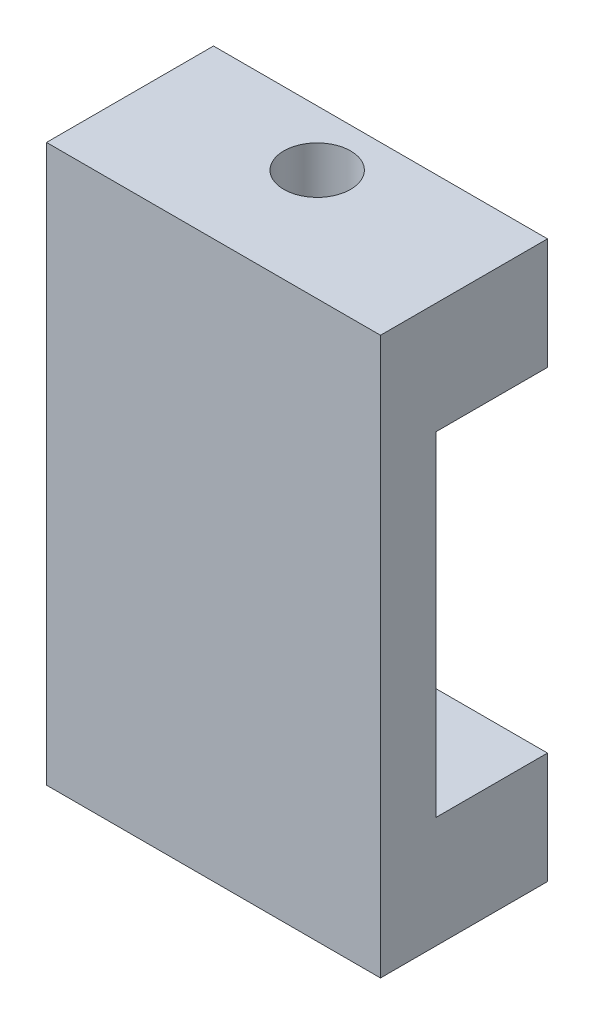
ISO-10303-21;
HEADER;
FILE_DESCRIPTION(('STEP AP214'),'2;1');
FILE_NAME('part.step','',(''),(''),'','','');
FILE_SCHEMA(('AUTOMOTIVE_DESIGN { 1 0 10303 214 1 1 1 1 }'));
ENDSEC;
DATA;
#1=APPLICATION_CONTEXT('core data for automotive mechanical design processes');
#2=APPLICATION_PROTOCOL_DEFINITION('international standard','automotive_design',2000,#1);
#3=PRODUCT_CONTEXT('',#1,'mechanical');
#4=PRODUCT('Part','Part','',(#3));
#5=PRODUCT_RELATED_PRODUCT_CATEGORY('part','',(#4));
#6=PRODUCT_DEFINITION_FORMATION('','',#4);
#7=PRODUCT_DEFINITION_CONTEXT('part definition',#1,'design');
#8=PRODUCT_DEFINITION('design','',#6,#7);
#9=PRODUCT_DEFINITION_SHAPE('','',#8);
#10=(LENGTH_UNIT() NAMED_UNIT(*) SI_UNIT(.MILLI.,.METRE.));
#11=(NAMED_UNIT(*) PLANE_ANGLE_UNIT() SI_UNIT($,.RADIAN.));
#12=(NAMED_UNIT(*) SI_UNIT($,.STERADIAN.) SOLID_ANGLE_UNIT());
#13=UNCERTAINTY_MEASURE_WITH_UNIT(LENGTH_MEASURE(1.E-05),#10,'distance_accuracy_value','');
#14=(GEOMETRIC_REPRESENTATION_CONTEXT(3) GLOBAL_UNCERTAINTY_ASSIGNED_CONTEXT((#13)) GLOBAL_UNIT_ASSIGNED_CONTEXT((#10,
#11,#12)) REPRESENTATION_CONTEXT('',''));
#15=CARTESIAN_POINT('',(0.,0.,0.));
#16=DIRECTION('',(0.,0.,1.));
#17=DIRECTION('',(1.,0.,0.));
#18=AXIS2_PLACEMENT_3D('',#15,#16,#17);
#19=CARTESIAN_POINT('',(-15.,0.,-2.5));
#20=DIRECTION('',(1.,0.,0.));
#21=DIRECTION('',(0.,1.,0.));
#22=AXIS2_PLACEMENT_3D('',#19,#20,#21);
#23=PLANE('',#22);
#24=DIRECTION('',(0.,1.,0.));
#25=VECTOR('',#24,1.);
#26=CARTESIAN_POINT('',(-15.,0.,-2.5));
#27=LINE('',#26,#25);
#28=CARTESIAN_POINT('',(-15.,-15.,-2.5));
#29=VERTEX_POINT('',#28);
#30=CARTESIAN_POINT('',(-15.,15.,-2.5));
#31=VERTEX_POINT('',#30);
#32=EDGE_CURVE('E166',#29,#31,#27,.T.);
#33=ORIENTED_EDGE('',*,*,#32,.F.);
#34=DIRECTION('',(0.,0.,1.));
#35=VECTOR('',#34,1.);
#36=CARTESIAN_POINT('',(-15.,-15.,2.5));
#37=LINE('',#36,#35);
#38=CARTESIAN_POINT('',(-15.,-15.,-12.5));
#39=VERTEX_POINT('',#38);
#40=EDGE_CURVE('E56',#39,#29,#37,.T.);
#41=ORIENTED_EDGE('',*,*,#40,.F.);
#42=DIRECTION('',(0.,1.,0.));
#43=VECTOR('',#42,1.);
#44=CARTESIAN_POINT('',(-15.,-25.,-12.5));
#45=LINE('',#44,#43);
#46=CARTESIAN_POINT('',(-15.,-25.,-12.5));
#47=VERTEX_POINT('',#46);
#48=EDGE_CURVE('E99',#47,#39,#45,.T.);
#49=ORIENTED_EDGE('',*,*,#48,.F.);
#50=DIRECTION('',(0.,0.,1.));
#51=VECTOR('',#50,1.);
#52=CARTESIAN_POINT('',(-15.,-25.,2.5));
#53=LINE('',#52,#51);
#54=CARTESIAN_POINT('',(-15.,-25.,2.5));
#55=VERTEX_POINT('',#54);
#56=EDGE_CURVE('E102',#47,#55,#53,.T.);
#57=ORIENTED_EDGE('',*,*,#56,.T.);
#58=DIRECTION('',(0.,1.,0.));
#59=VECTOR('',#58,1.);
#60=CARTESIAN_POINT('',(-15.,0.,2.5));
#61=LINE('',#60,#59);
#62=CARTESIAN_POINT('',(-15.,25.,2.5));
#63=VERTEX_POINT('',#62);
#64=EDGE_CURVE('E162',#55,#63,#61,.T.);
#65=ORIENTED_EDGE('',*,*,#64,.T.);
#66=DIRECTION('',(0.,0.,1.));
#67=VECTOR('',#66,1.);
#68=CARTESIAN_POINT('',(-15.,25.,2.5));
#69=LINE('',#68,#67);
#70=CARTESIAN_POINT('',(-15.,25.,-12.5));
#71=VERTEX_POINT('',#70);
#72=EDGE_CURVE('E140',#71,#63,#69,.T.);
#73=ORIENTED_EDGE('',*,*,#72,.F.);
#74=DIRECTION('',(0.,-1.,0.));
#75=VECTOR('',#74,1.);
#76=CARTESIAN_POINT('',(-15.,25.,-12.5));
#77=LINE('',#76,#75);
#78=CARTESIAN_POINT('',(-15.,15.,-12.5));
#79=VERTEX_POINT('',#78);
#80=EDGE_CURVE('E151',#71,#79,#77,.T.);
#81=ORIENTED_EDGE('',*,*,#80,.T.);
#82=DIRECTION('',(0.,0.,1.));
#83=VECTOR('',#82,1.);
#84=CARTESIAN_POINT('',(-15.,15.,2.5));
#85=LINE('',#84,#83);
#86=EDGE_CURVE('E137',#79,#31,#85,.T.);
#87=ORIENTED_EDGE('',*,*,#86,.T.);
#88=EDGE_LOOP('',(#33,#41,#49,#57,#65,#73,#81,#87));
#89=FACE_BOUND('',#88,.T.);
#90=ADVANCED_FACE('F35',(#89),#23,.F.);
#91=CARTESIAN_POINT('',(15.,0.,-2.5));
#92=DIRECTION('',(1.,0.,0.));
#93=DIRECTION('',(0.,0.,-1.));
#94=AXIS2_PLACEMENT_3D('',#91,#92,#93);
#95=PLANE('',#94);
#96=DIRECTION('',(0.,1.,0.));
#97=VECTOR('',#96,1.);
#98=CARTESIAN_POINT('',(15.,0.,-2.5));
#99=LINE('',#98,#97);
#100=CARTESIAN_POINT('',(15.,-15.,-2.5));
#101=VERTEX_POINT('',#100);
#102=CARTESIAN_POINT('',(15.,15.,-2.5));
#103=VERTEX_POINT('',#102);
#104=EDGE_CURVE('E42',#101,#103,#99,.T.);
#105=ORIENTED_EDGE('',*,*,#104,.T.);
#106=DIRECTION('',(0.,0.,-1.));
#107=VECTOR('',#106,1.);
#108=CARTESIAN_POINT('',(15.,15.,2.5));
#109=LINE('',#108,#107);
#110=CARTESIAN_POINT('',(15.,15.,-12.5));
#111=VERTEX_POINT('',#110);
#112=EDGE_CURVE('E154',#103,#111,#109,.T.);
#113=ORIENTED_EDGE('',*,*,#112,.T.);
#114=DIRECTION('',(0.,-1.,0.));
#115=VECTOR('',#114,1.);
#116=CARTESIAN_POINT('',(15.,25.,-12.5));
#117=LINE('',#116,#115);
#118=CARTESIAN_POINT('',(15.,25.,-12.5));
#119=VERTEX_POINT('',#118);
#120=EDGE_CURVE('E159',#119,#111,#117,.T.);
#121=ORIENTED_EDGE('',*,*,#120,.F.);
#122=DIRECTION('',(0.,0.,-1.));
#123=VECTOR('',#122,1.);
#124=CARTESIAN_POINT('',(15.,25.,2.5));
#125=LINE('',#124,#123);
#126=CARTESIAN_POINT('',(15.,25.,2.5));
#127=VERTEX_POINT('',#126);
#128=EDGE_CURVE('E147',#127,#119,#125,.T.);
#129=ORIENTED_EDGE('',*,*,#128,.F.);
#130=DIRECTION('',(0.,1.,0.));
#131=VECTOR('',#130,1.);
#132=CARTESIAN_POINT('',(15.,0.,2.5));
#133=LINE('',#132,#131);
#134=CARTESIAN_POINT('',(15.,-25.,2.5));
#135=VERTEX_POINT('',#134);
#136=EDGE_CURVE('E164',#135,#127,#133,.T.);
#137=ORIENTED_EDGE('',*,*,#136,.F.);
#138=DIRECTION('',(0.,0.,-1.));
#139=VECTOR('',#138,1.);
#140=CARTESIAN_POINT('',(15.,-25.,2.5));
#141=LINE('',#140,#139);
#142=CARTESIAN_POINT('',(15.,-25.,-12.5));
#143=VERTEX_POINT('',#142);
#144=EDGE_CURVE('E122',#135,#143,#141,.T.);
#145=ORIENTED_EDGE('',*,*,#144,.T.);
#146=DIRECTION('',(0.,1.,0.));
#147=VECTOR('',#146,1.);
#148=CARTESIAN_POINT('',(15.,-25.,-12.5));
#149=LINE('',#148,#147);
#150=CARTESIAN_POINT('',(15.,-15.,-12.5));
#151=VERTEX_POINT('',#150);
#152=EDGE_CURVE('E108',#143,#151,#149,.T.);
#153=ORIENTED_EDGE('',*,*,#152,.T.);
#154=DIRECTION('',(0.,0.,-1.));
#155=VECTOR('',#154,1.);
#156=CARTESIAN_POINT('',(15.,-15.,2.5));
#157=LINE('',#156,#155);
#158=EDGE_CURVE('E118',#101,#151,#157,.T.);
#159=ORIENTED_EDGE('',*,*,#158,.F.);
#160=EDGE_LOOP('',(#105,#113,#121,#129,#137,#145,#153,#159));
#161=FACE_BOUND('',#160,.T.);
#162=ADVANCED_FACE('F180',(#161),#95,.T.);
#163=CARTESIAN_POINT('',(0.,0.,-2.5));
#164=DIRECTION('',(0.,0.,1.));
#165=DIRECTION('',(1.,0.,0.));
#166=AXIS2_PLACEMENT_3D('',#163,#164,#165);
#167=PLANE('',#166);
#168=ORIENTED_EDGE('',*,*,#32,.T.);
#169=DIRECTION('',(-1.,0.,0.));
#170=VECTOR('',#169,1.);
#171=CARTESIAN_POINT('',(0.,15.,-2.5));
#172=LINE('',#171,#170);
#173=EDGE_CURVE('E11',#103,#31,#172,.T.);
#174=ORIENTED_EDGE('',*,*,#173,.F.);
#175=ORIENTED_EDGE('',*,*,#104,.F.);
#176=DIRECTION('',(-1.,0.,0.));
#177=VECTOR('',#176,1.);
#178=CARTESIAN_POINT('',(0.,-15.,-2.5));
#179=LINE('',#178,#177);
#180=EDGE_CURVE('E168',#101,#29,#179,.T.);
#181=ORIENTED_EDGE('',*,*,#180,.T.);
#182=EDGE_LOOP('',(#168,#174,#175,#181));
#183=FACE_BOUND('',#182,.T.);
#184=ADVANCED_FACE('F170',(#183),#167,.F.);
#185=CARTESIAN_POINT('',(0.,0.,2.5));
#186=DIRECTION('',(0.,0.,1.));
#187=DIRECTION('',(1.,0.,0.));
#188=AXIS2_PLACEMENT_3D('',#185,#186,#187);
#189=PLANE('',#188);
#190=ORIENTED_EDGE('',*,*,#64,.F.);
#191=DIRECTION('',(1.,0.,0.));
#192=VECTOR('',#191,1.);
#193=CARTESIAN_POINT('',(-15.,-25.,2.5));
#194=LINE('',#193,#192);
#195=EDGE_CURVE('E117',#55,#135,#194,.T.);
#196=ORIENTED_EDGE('',*,*,#195,.T.);
#197=ORIENTED_EDGE('',*,*,#136,.T.);
#198=DIRECTION('',(1.,0.,0.));
#199=VECTOR('',#198,1.);
#200=CARTESIAN_POINT('',(-15.,25.,2.5));
#201=LINE('',#200,#199);
#202=EDGE_CURVE('E143',#63,#127,#201,.T.);
#203=ORIENTED_EDGE('',*,*,#202,.F.);
#204=EDGE_LOOP('',(#190,#196,#197,#203));
#205=FACE_BOUND('',#204,.T.);
#206=ADVANCED_FACE('F190',(#205),#189,.T.);
#207=CARTESIAN_POINT('',(0.,25.,0.));
#208=DIRECTION('',(0.,-1.,0.));
#209=DIRECTION('',(1.,0.,0.));
#210=AXIS2_PLACEMENT_3D('',#207,#208,#209);
#211=PLANE('',#210);
#212=ORIENTED_EDGE('',*,*,#72,.T.);
#213=ORIENTED_EDGE('',*,*,#202,.T.);
#214=ORIENTED_EDGE('',*,*,#128,.T.);
#215=DIRECTION('',(-1.,0.,0.));
#216=VECTOR('',#215,1.);
#217=CARTESIAN_POINT('',(-15.,25.,-12.5));
#218=LINE('',#217,#216);
#219=EDGE_CURVE('E149',#119,#71,#218,.T.);
#220=ORIENTED_EDGE('',*,*,#219,.T.);
#221=EDGE_LOOP('',(#212,#213,#214,#220));
#222=FACE_BOUND('',#221,.T.);
#223=CARTESIAN_POINT('',(-0.685637394425955,25.,-7.5));
#224=DIRECTION('',(0.,1.,0.));
#225=DIRECTION('',(-1.,0.,0.));
#226=AXIS2_PLACEMENT_3D('',#223,#224,#225);
#227=CIRCLE('',#226,3.);
#228=CARTESIAN_POINT('',(-3.68563739442595,25.,-7.5));
#229=VERTEX_POINT('',#228);
#230=EDGE_CURVE('E134',#229,#229,#227,.T.);
#231=ORIENTED_EDGE('',*,*,#230,.F.);
#232=EDGE_LOOP('',(#231));
#233=FACE_BOUND('',#232,.T.);
#234=ADVANCED_FACE('F186',(#222,#233),#211,.F.);
#235=CARTESIAN_POINT('',(0.,15.,0.));
#236=DIRECTION('',(0.,-1.,0.));
#237=DIRECTION('',(1.,0.,0.));
#238=AXIS2_PLACEMENT_3D('',#235,#236,#237);
#239=PLANE('',#238);
#240=ORIENTED_EDGE('',*,*,#112,.F.);
#241=ORIENTED_EDGE('',*,*,#173,.T.);
#242=ORIENTED_EDGE('',*,*,#86,.F.);
#243=DIRECTION('',(-1.,0.,0.));
#244=VECTOR('',#243,1.);
#245=CARTESIAN_POINT('',(-15.,15.,-12.5));
#246=LINE('',#245,#244);
#247=EDGE_CURVE('E144',#111,#79,#246,.T.);
#248=ORIENTED_EDGE('',*,*,#247,.F.);
#249=EDGE_LOOP('',(#240,#241,#242,#248));
#250=FACE_BOUND('',#249,.T.);
#251=CARTESIAN_POINT('',(-0.685637394425954,15.,-7.5));
#252=DIRECTION('',(0.,1.,0.));
#253=DIRECTION('',(-1.,0.,0.));
#254=AXIS2_PLACEMENT_3D('',#251,#252,#253);
#255=CIRCLE('',#254,3.);
#256=CARTESIAN_POINT('',(-3.68563739442595,15.,-7.5));
#257=VERTEX_POINT('',#256);
#258=EDGE_CURVE('E107',#257,#257,#255,.T.);
#259=ORIENTED_EDGE('',*,*,#258,.T.);
#260=EDGE_LOOP('',(#259));
#261=FACE_BOUND('',#260,.T.);
#262=ADVANCED_FACE('F177',(#250,#261),#239,.T.);
#263=CARTESIAN_POINT('',(-15.,25.,-12.5));
#264=DIRECTION('',(0.,0.,1.));
#265=DIRECTION('',(1.,0.,0.));
#266=AXIS2_PLACEMENT_3D('',#263,#264,#265);
#267=PLANE('',#266);
#268=ORIENTED_EDGE('',*,*,#247,.T.);
#269=ORIENTED_EDGE('',*,*,#80,.F.);
#270=ORIENTED_EDGE('',*,*,#219,.F.);
#271=ORIENTED_EDGE('',*,*,#120,.T.);
#272=EDGE_LOOP('',(#268,#269,#270,#271));
#273=FACE_BOUND('',#272,.T.);
#274=ADVANCED_FACE('F184',(#273),#267,.F.);
#275=CARTESIAN_POINT('',(-0.685637394425955,25.,-7.5));
#276=DIRECTION('',(0.,-1.,0.));
#277=DIRECTION('',(1.,0.,0.));
#278=AXIS2_PLACEMENT_3D('',#275,#276,#277);
#279=CYLINDRICAL_SURFACE('',#278,3.);
#280=ORIENTED_EDGE('',*,*,#230,.T.);
#281=EDGE_LOOP('',(#280));
#282=FACE_BOUND('',#281,.T.);
#283=ORIENTED_EDGE('',*,*,#258,.F.);
#284=EDGE_LOOP('',(#283));
#285=FACE_BOUND('',#284,.T.);
#286=ADVANCED_FACE('F227',(#282,#285),#279,.F.);
#287=CARTESIAN_POINT('',(0.,-15.,0.));
#288=DIRECTION('',(0.,1.,0.));
#289=DIRECTION('',(1.,0.,0.));
#290=AXIS2_PLACEMENT_3D('',#287,#288,#289);
#291=PLANE('',#290);
#292=CARTESIAN_POINT('',(-0.685637394425954,-15.,-7.5));
#293=DIRECTION('',(0.,1.,0.));
#294=DIRECTION('',(-1.,0.,0.));
#295=AXIS2_PLACEMENT_3D('',#292,#293,#294);
#296=CIRCLE('',#295,3.);
#297=CARTESIAN_POINT('',(-3.68563739442595,-15.,-7.5));
#298=VERTEX_POINT('',#297);
#299=EDGE_CURVE('E336',#298,#298,#296,.T.);
#300=ORIENTED_EDGE('',*,*,#299,.F.);
#301=EDGE_LOOP('',(#300));
#302=FACE_BOUND('',#301,.T.);
#303=ORIENTED_EDGE('',*,*,#180,.F.);
#304=ORIENTED_EDGE('',*,*,#158,.T.);
#305=DIRECTION('',(-1.,0.,0.));
#306=VECTOR('',#305,1.);
#307=CARTESIAN_POINT('',(-15.,-15.,-12.5));
#308=LINE('',#307,#306);
#309=EDGE_CURVE('E129',#151,#39,#308,.T.);
#310=ORIENTED_EDGE('',*,*,#309,.T.);
#311=ORIENTED_EDGE('',*,*,#40,.T.);
#312=EDGE_LOOP('',(#303,#304,#310,#311));
#313=FACE_BOUND('',#312,.T.);
#314=ADVANCED_FACE('F223',(#302,#313),#291,.T.);
#315=CARTESIAN_POINT('',(-15.,-25.,-12.5));
#316=DIRECTION('',(0.,0.,-1.));
#317=DIRECTION('',(-1.,0.,0.));
#318=AXIS2_PLACEMENT_3D('',#315,#316,#317);
#319=PLANE('',#318);
#320=ORIENTED_EDGE('',*,*,#309,.F.);
#321=ORIENTED_EDGE('',*,*,#152,.F.);
#322=DIRECTION('',(-1.,0.,0.));
#323=VECTOR('',#322,1.);
#324=CARTESIAN_POINT('',(-15.,-25.,-12.5));
#325=LINE('',#324,#323);
#326=EDGE_CURVE('E114',#143,#47,#325,.T.);
#327=ORIENTED_EDGE('',*,*,#326,.T.);
#328=ORIENTED_EDGE('',*,*,#48,.T.);
#329=EDGE_LOOP('',(#320,#321,#327,#328));
#330=FACE_BOUND('',#329,.T.);
#331=ADVANCED_FACE('F120',(#330),#319,.T.);
#332=CARTESIAN_POINT('',(0.,-25.,0.));
#333=DIRECTION('',(0.,1.,0.));
#334=DIRECTION('',(1.,0.,0.));
#335=AXIS2_PLACEMENT_3D('',#332,#333,#334);
#336=PLANE('',#335);
#337=CARTESIAN_POINT('',(-0.685637394425955,-25.,-7.5));
#338=DIRECTION('',(0.,1.,0.));
#339=DIRECTION('',(-1.,0.,0.));
#340=AXIS2_PLACEMENT_3D('',#337,#338,#339);
#341=CIRCLE('',#340,3.);
#342=CARTESIAN_POINT('',(-3.68563739442595,-25.,-7.5));
#343=VERTEX_POINT('',#342);
#344=EDGE_CURVE('E130',#343,#343,#341,.T.);
#345=ORIENTED_EDGE('',*,*,#344,.T.);
#346=EDGE_LOOP('',(#345));
#347=FACE_BOUND('',#346,.T.);
#348=ORIENTED_EDGE('',*,*,#56,.F.);
#349=ORIENTED_EDGE('',*,*,#326,.F.);
#350=ORIENTED_EDGE('',*,*,#144,.F.);
#351=ORIENTED_EDGE('',*,*,#195,.F.);
#352=EDGE_LOOP('',(#348,#349,#350,#351));
#353=FACE_BOUND('',#352,.T.);
#354=ADVANCED_FACE('F112',(#347,#353),#336,.F.);
#355=CARTESIAN_POINT('',(-0.685637394425955,-25.,-7.5));
#356=DIRECTION('',(0.,1.,0.));
#357=DIRECTION('',(-1.,0.,0.));
#358=AXIS2_PLACEMENT_3D('',#355,#356,#357);
#359=CYLINDRICAL_SURFACE('',#358,3.);
#360=ORIENTED_EDGE('',*,*,#344,.F.);
#361=EDGE_LOOP('',(#360));
#362=FACE_BOUND('',#361,.T.);
#363=ORIENTED_EDGE('',*,*,#299,.T.);
#364=EDGE_LOOP('',(#363));
#365=FACE_BOUND('',#364,.T.);
#366=ADVANCED_FACE('F246',(#362,#365),#359,.F.);
#367=CLOSED_SHELL('',(#90,#162,#184,#206,#234,#262,#274,#286,#314,#331,#354,#366));
#368=MANIFOLD_SOLID_BREP('B2',#367);
#369=ADVANCED_BREP_SHAPE_REPRESENTATION('',(#18,#368),#14);
#370=SHAPE_DEFINITION_REPRESENTATION(#9,#369);
ENDSEC;
END-ISO-10303-21;
